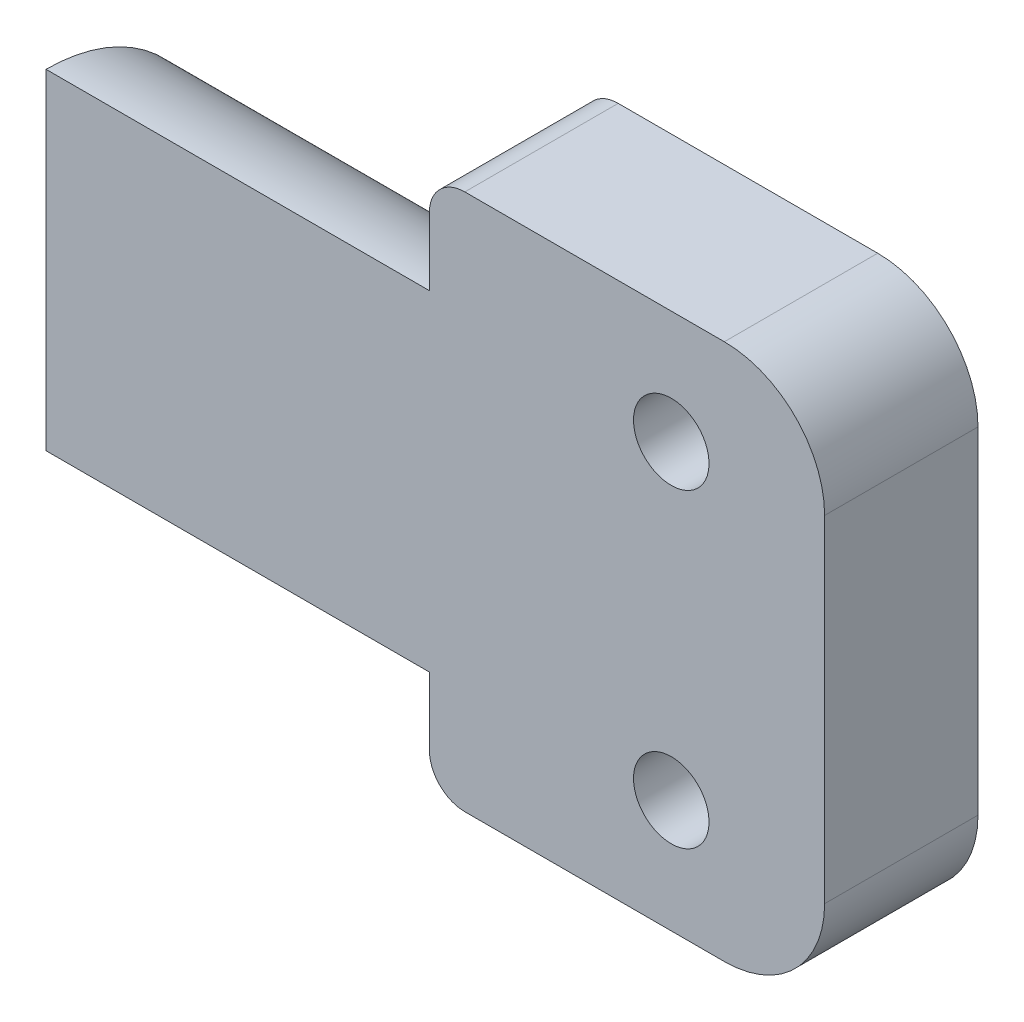
ISO-10303-21;
HEADER;
FILE_DESCRIPTION(('STEP AP214'),'2;1');
FILE_NAME('part.step','',(''),(''),'','','');
FILE_SCHEMA(('AUTOMOTIVE_DESIGN { 1 0 10303 214 1 1 1 1 }'));
ENDSEC;
DATA;
#1=APPLICATION_CONTEXT('core data for automotive mechanical design processes');
#2=APPLICATION_PROTOCOL_DEFINITION('international standard','automotive_design',2000,#1);
#3=PRODUCT_CONTEXT('',#1,'mechanical');
#4=PRODUCT('Part','Part','',(#3));
#5=PRODUCT_RELATED_PRODUCT_CATEGORY('part','',(#4));
#6=PRODUCT_DEFINITION_FORMATION('','',#4);
#7=PRODUCT_DEFINITION_CONTEXT('part definition',#1,'design');
#8=PRODUCT_DEFINITION('design','',#6,#7);
#9=PRODUCT_DEFINITION_SHAPE('','',#8);
#10=(LENGTH_UNIT() NAMED_UNIT(*) SI_UNIT(.MILLI.,.METRE.));
#11=(NAMED_UNIT(*) PLANE_ANGLE_UNIT() SI_UNIT($,.RADIAN.));
#12=(NAMED_UNIT(*) SI_UNIT($,.STERADIAN.) SOLID_ANGLE_UNIT());
#13=UNCERTAINTY_MEASURE_WITH_UNIT(LENGTH_MEASURE(1.E-05),#10,'distance_accuracy_value','');
#14=(GEOMETRIC_REPRESENTATION_CONTEXT(3) GLOBAL_UNCERTAINTY_ASSIGNED_CONTEXT((#13)) GLOBAL_UNIT_ASSIGNED_CONTEXT((#10,
#11,#12)) REPRESENTATION_CONTEXT('',''));
#15=CARTESIAN_POINT('',(0.,0.,0.));
#16=DIRECTION('',(0.,0.,1.));
#17=DIRECTION('',(1.,0.,0.));
#18=AXIS2_PLACEMENT_3D('',#15,#16,#17);
#19=CARTESIAN_POINT('',(165.5,94.25,93.6));
#20=DIRECTION('',(0.,0.,-1.));
#21=DIRECTION('',(-1.,0.,0.));
#22=AXIS2_PLACEMENT_3D('',#19,#20,#21);
#23=PLANE('',#22);
#24=CARTESIAN_POINT('',(165.5,94.25,93.6));
#25=DIRECTION('',(0.,0.,1.));
#26=DIRECTION('',(1.,0.,0.));
#27=AXIS2_PLACEMENT_3D('',#24,#25,#26);
#28=CIRCLE('',#27,3.09999999999999);
#29=CARTESIAN_POINT('',(168.6,94.25,93.6));
#30=VERTEX_POINT('',#29);
#31=EDGE_CURVE('E19',#30,#30,#28,.F.);
#32=ORIENTED_EDGE('',*,*,#31,.T.);
#33=EDGE_LOOP('',(#32));
#34=FACE_BOUND('',#33,.T.);
#35=ADVANCED_FACE('F16',(#34),#23,.T.);
#36=CARTESIAN_POINT('',(165.5,123.75,93.6));
#37=DIRECTION('',(0.,0.,-1.));
#38=DIRECTION('',(-1.,0.,0.));
#39=AXIS2_PLACEMENT_3D('',#36,#37,#38);
#40=PLANE('',#39);
#41=CARTESIAN_POINT('',(165.5,123.75,93.6));
#42=DIRECTION('',(0.,0.,1.));
#43=DIRECTION('',(1.,0.,0.));
#44=AXIS2_PLACEMENT_3D('',#41,#42,#43);
#45=CIRCLE('',#44,3.09999999999999);
#46=CARTESIAN_POINT('',(168.6,123.75,93.6));
#47=VERTEX_POINT('',#46);
#48=EDGE_CURVE('E239',#47,#47,#45,.F.);
#49=ORIENTED_EDGE('',*,*,#48,.T.);
#50=EDGE_LOOP('',(#49));
#51=FACE_BOUND('',#50,.T.);
#52=ADVANCED_FACE('F254',(#51),#40,.T.);
#53=CARTESIAN_POINT('',(165.5,94.25,84.1));
#54=DIRECTION('',(0.,0.,1.));
#55=DIRECTION('',(1.,0.,0.));
#56=AXIS2_PLACEMENT_3D('',#53,#54,#55);
#57=CYLINDRICAL_SURFACE('',#56,3.09999999999999);
#58=ORIENTED_EDGE('',*,*,#31,.F.);
#59=EDGE_LOOP('',(#58));
#60=FACE_BOUND('',#59,.T.);
#61=CARTESIAN_POINT('',(165.5,94.25,84.1));
#62=DIRECTION('',(0.,0.,1.));
#63=DIRECTION('',(1.,0.,0.));
#64=AXIS2_PLACEMENT_3D('',#61,#62,#63);
#65=CIRCLE('',#64,3.09999999999999);
#66=CARTESIAN_POINT('',(168.6,94.25,84.1));
#67=VERTEX_POINT('',#66);
#68=EDGE_CURVE('E236',#67,#67,#65,.T.);
#69=ORIENTED_EDGE('',*,*,#68,.F.);
#70=EDGE_LOOP('',(#69));
#71=FACE_BOUND('',#70,.T.);
#72=ADVANCED_FACE('F250',(#60,#71),#57,.F.);
#73=CARTESIAN_POINT('',(165.5,123.75,84.1));
#74=DIRECTION('',(0.,0.,1.));
#75=DIRECTION('',(1.,0.,0.));
#76=AXIS2_PLACEMENT_3D('',#73,#74,#75);
#77=CYLINDRICAL_SURFACE('',#76,3.09999999999999);
#78=ORIENTED_EDGE('',*,*,#48,.F.);
#79=EDGE_LOOP('',(#78));
#80=FACE_BOUND('',#79,.T.);
#81=CARTESIAN_POINT('',(165.5,123.75,84.1));
#82=DIRECTION('',(0.,0.,1.));
#83=DIRECTION('',(1.,0.,0.));
#84=AXIS2_PLACEMENT_3D('',#81,#82,#83);
#85=CIRCLE('',#84,3.09999999999999);
#86=CARTESIAN_POINT('',(168.6,123.75,84.1));
#87=VERTEX_POINT('',#86);
#88=EDGE_CURVE('E229',#87,#87,#85,.T.);
#89=ORIENTED_EDGE('',*,*,#88,.F.);
#90=EDGE_LOOP('',(#89));
#91=FACE_BOUND('',#90,.T.);
#92=ADVANCED_FACE('F253',(#80,#91),#77,.F.);
#93=CARTESIAN_POINT('',(180.,118.405,84.1));
#94=DIRECTION('',(0.,0.,1.));
#95=DIRECTION('',(1.,0.,0.));
#96=AXIS2_PLACEMENT_3D('',#93,#94,#95);
#97=CYLINDRICAL_SURFACE('',#96,2.);
#98=DIRECTION('',(0.,0.,-1.));
#99=VECTOR('',#98,1.);
#100=CARTESIAN_POINT('',(182.,118.405,84.1));
#101=LINE('',#100,#99);
#102=CARTESIAN_POINT('',(182.,118.405,91.1));
#103=VERTEX_POINT('',#102);
#104=CARTESIAN_POINT('',(182.,118.405,84.1));
#105=VERTEX_POINT('',#104);
#106=EDGE_CURVE('E372',#103,#105,#101,.T.);
#107=ORIENTED_EDGE('',*,*,#106,.T.);
#108=CARTESIAN_POINT('',(180.,118.405,84.1));
#109=DIRECTION('',(0.,0.,1.));
#110=DIRECTION('',(1.,0.,0.));
#111=AXIS2_PLACEMENT_3D('',#108,#109,#110);
#112=CIRCLE('',#111,2.);
#113=CARTESIAN_POINT('',(180.,116.405,84.1));
#114=VERTEX_POINT('',#113);
#115=EDGE_CURVE('E336',#114,#105,#112,.T.);
#116=ORIENTED_EDGE('',*,*,#115,.F.);
#117=DIRECTION('',(0.,0.,-1.));
#118=VECTOR('',#117,1.);
#119=CARTESIAN_POINT('',(180.,116.405,84.1));
#120=LINE('',#119,#118);
#121=CARTESIAN_POINT('',(180.,116.405,91.1));
#122=VERTEX_POINT('',#121);
#123=EDGE_CURVE('E241',#114,#122,#120,.F.);
#124=ORIENTED_EDGE('',*,*,#123,.T.);
#125=CARTESIAN_POINT('',(180.,118.405,91.1));
#126=DIRECTION('',(0.,0.,1.));
#127=DIRECTION('',(1.,0.,0.));
#128=AXIS2_PLACEMENT_3D('',#125,#126,#127);
#129=CIRCLE('',#128,2.);
#130=EDGE_CURVE('E323',#103,#122,#129,.F.);
#131=ORIENTED_EDGE('',*,*,#130,.F.);
#132=EDGE_LOOP('',(#107,#116,#124,#131));
#133=FACE_BOUND('',#132,.T.);
#134=ADVANCED_FACE('F558',(#133),#97,.F.);
#135=CARTESIAN_POINT('',(172.,116.405,84.1));
#136=DIRECTION('',(0.,-1.,0.));
#137=DIRECTION('',(0.,0.,-1.));
#138=AXIS2_PLACEMENT_3D('',#135,#136,#137);
#139=PLANE('',#138);
#140=DIRECTION('',(-1.,0.,0.));
#141=VECTOR('',#140,1.);
#142=CARTESIAN_POINT('',(157.,116.405,84.1));
#143=LINE('',#142,#141);
#144=CARTESIAN_POINT('',(174.,116.405,84.1));
#145=VERTEX_POINT('',#144);
#146=EDGE_CURVE('E337',#145,#114,#143,.F.);
#147=ORIENTED_EDGE('',*,*,#146,.F.);
#148=DIRECTION('',(0.,0.,1.));
#149=VECTOR('',#148,1.);
#150=CARTESIAN_POINT('',(174.,116.405,84.1));
#151=LINE('',#150,#149);
#152=CARTESIAN_POINT('',(174.,116.405,91.1));
#153=VERTEX_POINT('',#152);
#154=EDGE_CURVE('E244',#145,#153,#151,.T.);
#155=ORIENTED_EDGE('',*,*,#154,.T.);
#156=DIRECTION('',(-1.,0.,0.));
#157=VECTOR('',#156,1.);
#158=CARTESIAN_POINT('',(177.,116.405,91.1));
#159=LINE('',#158,#157);
#160=EDGE_CURVE('E320',#122,#153,#159,.T.);
#161=ORIENTED_EDGE('',*,*,#160,.F.);
#162=ORIENTED_EDGE('',*,*,#123,.F.);
#163=EDGE_LOOP('',(#147,#155,#161,#162));
#164=FACE_BOUND('',#163,.T.);
#165=ADVANCED_FACE('F562',(#164),#139,.F.);
#166=CARTESIAN_POINT('',(174.,118.405,84.1));
#167=DIRECTION('',(0.,0.,1.));
#168=DIRECTION('',(1.,0.,0.));
#169=AXIS2_PLACEMENT_3D('',#166,#167,#168);
#170=CYLINDRICAL_SURFACE('',#169,2.);
#171=ORIENTED_EDGE('',*,*,#154,.F.);
#172=CARTESIAN_POINT('',(174.,118.405,84.1));
#173=DIRECTION('',(0.,0.,1.));
#174=DIRECTION('',(1.,0.,0.));
#175=AXIS2_PLACEMENT_3D('',#172,#173,#174);
#176=CIRCLE('',#175,2.);
#177=CARTESIAN_POINT('',(172.,118.405,84.1));
#178=VERTEX_POINT('',#177);
#179=EDGE_CURVE('E327',#178,#145,#176,.T.);
#180=ORIENTED_EDGE('',*,*,#179,.F.);
#181=DIRECTION('',(0.,0.,1.));
#182=VECTOR('',#181,1.);
#183=CARTESIAN_POINT('',(172.,118.405,84.1));
#184=LINE('',#183,#182);
#185=CARTESIAN_POINT('',(172.,118.405,91.1));
#186=VERTEX_POINT('',#185);
#187=EDGE_CURVE('E382',#178,#186,#184,.T.);
#188=ORIENTED_EDGE('',*,*,#187,.T.);
#189=CARTESIAN_POINT('',(174.,118.405,91.1));
#190=DIRECTION('',(0.,0.,1.));
#191=DIRECTION('',(1.,0.,0.));
#192=AXIS2_PLACEMENT_3D('',#189,#190,#191);
#193=CIRCLE('',#192,2.);
#194=EDGE_CURVE('E319',#153,#186,#193,.F.);
#195=ORIENTED_EDGE('',*,*,#194,.F.);
#196=EDGE_LOOP('',(#171,#180,#188,#195));
#197=FACE_BOUND('',#196,.T.);
#198=ADVANCED_FACE('F566',(#197),#170,.F.);
#199=CARTESIAN_POINT('',(172.,127.905,84.1));
#200=DIRECTION('',(-1.,0.,0.));
#201=DIRECTION('',(0.,0.,1.));
#202=AXIS2_PLACEMENT_3D('',#199,#200,#201);
#203=PLANE('',#202);
#204=DIRECTION('',(0.,1.,0.));
#205=VECTOR('',#204,1.);
#206=CARTESIAN_POINT('',(172.,109.,84.1));
#207=LINE('',#206,#205);
#208=CARTESIAN_POINT('',(172.,125.905,84.1));
#209=VERTEX_POINT('',#208);
#210=EDGE_CURVE('E324',#209,#178,#207,.F.);
#211=ORIENTED_EDGE('',*,*,#210,.F.);
#212=DIRECTION('',(0.,0.,1.));
#213=VECTOR('',#212,1.);
#214=CARTESIAN_POINT('',(172.,125.905,84.1));
#215=LINE('',#214,#213);
#216=CARTESIAN_POINT('',(172.,125.905,91.1));
#217=VERTEX_POINT('',#216);
#218=EDGE_CURVE('E380',#209,#217,#215,.T.);
#219=ORIENTED_EDGE('',*,*,#218,.T.);
#220=DIRECTION('',(0.,1.,0.));
#221=VECTOR('',#220,1.);
#222=CARTESIAN_POINT('',(172.,122.155,91.1));
#223=LINE('',#222,#221);
#224=EDGE_CURVE('E316',#186,#217,#223,.T.);
#225=ORIENTED_EDGE('',*,*,#224,.F.);
#226=ORIENTED_EDGE('',*,*,#187,.F.);
#227=EDGE_LOOP('',(#211,#219,#225,#226));
#228=FACE_BOUND('',#227,.T.);
#229=ADVANCED_FACE('F570',(#228),#203,.F.);
#230=CARTESIAN_POINT('',(174.,125.905,84.1));
#231=DIRECTION('',(0.,0.,1.));
#232=DIRECTION('',(1.,0.,0.));
#233=AXIS2_PLACEMENT_3D('',#230,#231,#232);
#234=CYLINDRICAL_SURFACE('',#233,2.);
#235=ORIENTED_EDGE('',*,*,#218,.F.);
#236=CARTESIAN_POINT('',(174.,125.905,84.1));
#237=DIRECTION('',(0.,0.,1.));
#238=DIRECTION('',(1.,0.,0.));
#239=AXIS2_PLACEMENT_3D('',#236,#237,#238);
#240=CIRCLE('',#239,2.);
#241=CARTESIAN_POINT('',(174.,127.905,84.1));
#242=VERTEX_POINT('',#241);
#243=EDGE_CURVE('E328',#242,#209,#240,.T.);
#244=ORIENTED_EDGE('',*,*,#243,.F.);
#245=DIRECTION('',(0.,0.,1.));
#246=VECTOR('',#245,1.);
#247=CARTESIAN_POINT('',(174.,127.905,84.1));
#248=LINE('',#247,#246);
#249=CARTESIAN_POINT('',(174.,127.905,91.1));
#250=VERTEX_POINT('',#249);
#251=EDGE_CURVE('E378',#242,#250,#248,.T.);
#252=ORIENTED_EDGE('',*,*,#251,.T.);
#253=CARTESIAN_POINT('',(174.,125.905,91.1));
#254=DIRECTION('',(0.,0.,1.));
#255=DIRECTION('',(1.,0.,0.));
#256=AXIS2_PLACEMENT_3D('',#253,#254,#255);
#257=CIRCLE('',#256,2.);
#258=EDGE_CURVE('E315',#217,#250,#257,.F.);
#259=ORIENTED_EDGE('',*,*,#258,.F.);
#260=EDGE_LOOP('',(#235,#244,#252,#259));
#261=FACE_BOUND('',#260,.T.);
#262=ADVANCED_FACE('F573',(#261),#234,.F.);
#263=CARTESIAN_POINT('',(182.,127.905,84.1));
#264=DIRECTION('',(0.,1.,0.));
#265=DIRECTION('',(0.,0.,1.));
#266=AXIS2_PLACEMENT_3D('',#263,#264,#265);
#267=PLANE('',#266);
#268=DIRECTION('',(-1.,0.,0.));
#269=VECTOR('',#268,1.);
#270=CARTESIAN_POINT('',(177.,127.905,91.1));
#271=LINE('',#270,#269);
#272=CARTESIAN_POINT('',(180.,127.905,91.1));
#273=VERTEX_POINT('',#272);
#274=EDGE_CURVE('E312',#250,#273,#271,.F.);
#275=ORIENTED_EDGE('',*,*,#274,.F.);
#276=ORIENTED_EDGE('',*,*,#251,.F.);
#277=DIRECTION('',(-1.,0.,0.));
#278=VECTOR('',#277,1.);
#279=CARTESIAN_POINT('',(157.,127.905,84.1));
#280=LINE('',#279,#278);
#281=CARTESIAN_POINT('',(180.,127.905,84.1));
#282=VERTEX_POINT('',#281);
#283=EDGE_CURVE('E329',#282,#242,#280,.T.);
#284=ORIENTED_EDGE('',*,*,#283,.F.);
#285=DIRECTION('',(0.,0.,1.));
#286=VECTOR('',#285,1.);
#287=CARTESIAN_POINT('',(180.,127.905,84.1));
#288=LINE('',#287,#286);
#289=EDGE_CURVE('E375',#282,#273,#288,.T.);
#290=ORIENTED_EDGE('',*,*,#289,.T.);
#291=EDGE_LOOP('',(#275,#276,#284,#290));
#292=FACE_BOUND('',#291,.T.);
#293=ADVANCED_FACE('F576',(#292),#267,.F.);
#294=CARTESIAN_POINT('',(180.,125.905,84.1));
#295=DIRECTION('',(0.,0.,1.));
#296=DIRECTION('',(1.,0.,0.));
#297=AXIS2_PLACEMENT_3D('',#294,#295,#296);
#298=CYLINDRICAL_SURFACE('',#297,2.);
#299=ORIENTED_EDGE('',*,*,#289,.F.);
#300=CARTESIAN_POINT('',(180.,125.905,84.1));
#301=DIRECTION('',(0.,0.,1.));
#302=DIRECTION('',(1.,0.,0.));
#303=AXIS2_PLACEMENT_3D('',#300,#301,#302);
#304=CIRCLE('',#303,2.);
#305=CARTESIAN_POINT('',(182.,125.905,84.1));
#306=VERTEX_POINT('',#305);
#307=EDGE_CURVE('E332',#306,#282,#304,.T.);
#308=ORIENTED_EDGE('',*,*,#307,.F.);
#309=DIRECTION('',(0.,0.,-1.));
#310=VECTOR('',#309,1.);
#311=CARTESIAN_POINT('',(182.,125.905,84.1));
#312=LINE('',#311,#310);
#313=CARTESIAN_POINT('',(182.,125.905,91.1));
#314=VERTEX_POINT('',#313);
#315=EDGE_CURVE('E373',#306,#314,#312,.F.);
#316=ORIENTED_EDGE('',*,*,#315,.T.);
#317=CARTESIAN_POINT('',(180.,125.905,91.1));
#318=DIRECTION('',(0.,0.,1.));
#319=DIRECTION('',(1.,0.,0.));
#320=AXIS2_PLACEMENT_3D('',#317,#318,#319);
#321=CIRCLE('',#320,2.);
#322=EDGE_CURVE('E311',#273,#314,#321,.F.);
#323=ORIENTED_EDGE('',*,*,#322,.F.);
#324=EDGE_LOOP('',(#299,#308,#316,#323));
#325=FACE_BOUND('',#324,.T.);
#326=ADVANCED_FACE('F549',(#325),#298,.F.);
#327=CARTESIAN_POINT('',(182.,116.405,84.1));
#328=DIRECTION('',(1.,0.,0.));
#329=DIRECTION('',(0.,0.,-1.));
#330=AXIS2_PLACEMENT_3D('',#327,#328,#329);
#331=PLANE('',#330);
#332=DIRECTION('',(0.,1.,0.));
#333=VECTOR('',#332,1.);
#334=CARTESIAN_POINT('',(182.,122.155,91.1));
#335=LINE('',#334,#333);
#336=EDGE_CURVE('E308',#314,#103,#335,.F.);
#337=ORIENTED_EDGE('',*,*,#336,.F.);
#338=ORIENTED_EDGE('',*,*,#315,.F.);
#339=DIRECTION('',(0.,1.,0.));
#340=VECTOR('',#339,1.);
#341=CARTESIAN_POINT('',(182.,109.,84.1));
#342=LINE('',#341,#340);
#343=EDGE_CURVE('E333',#105,#306,#342,.T.);
#344=ORIENTED_EDGE('',*,*,#343,.F.);
#345=ORIENTED_EDGE('',*,*,#106,.F.);
#346=EDGE_LOOP('',(#337,#338,#344,#345));
#347=FACE_BOUND('',#346,.T.);
#348=ADVANCED_FACE('F555',(#347),#331,.F.);
#349=CARTESIAN_POINT('',(180.,99.595,84.1));
#350=DIRECTION('',(0.,0.,1.));
#351=DIRECTION('',(1.,0.,0.));
#352=AXIS2_PLACEMENT_3D('',#349,#350,#351);
#353=CYLINDRICAL_SURFACE('',#352,2.);
#354=DIRECTION('',(0.,0.,1.));
#355=VECTOR('',#354,1.);
#356=CARTESIAN_POINT('',(180.,101.595,84.1));
#357=LINE('',#356,#355);
#358=CARTESIAN_POINT('',(180.,101.595,91.1));
#359=VERTEX_POINT('',#358);
#360=CARTESIAN_POINT('',(180.,101.595,84.1));
#361=VERTEX_POINT('',#360);
#362=EDGE_CURVE('E238',#359,#361,#357,.F.);
#363=ORIENTED_EDGE('',*,*,#362,.T.);
#364=CARTESIAN_POINT('',(180.,99.595,84.1));
#365=DIRECTION('',(0.,0.,1.));
#366=DIRECTION('',(1.,0.,0.));
#367=AXIS2_PLACEMENT_3D('',#364,#365,#366);
#368=CIRCLE('',#367,2.);
#369=CARTESIAN_POINT('',(182.,99.595,84.1));
#370=VERTEX_POINT('',#369);
#371=EDGE_CURVE('E221',#370,#361,#368,.T.);
#372=ORIENTED_EDGE('',*,*,#371,.F.);
#373=DIRECTION('',(0.,0.,-1.));
#374=VECTOR('',#373,1.);
#375=CARTESIAN_POINT('',(182.,99.595,84.1));
#376=LINE('',#375,#374);
#377=CARTESIAN_POINT('',(182.,99.595,91.1));
#378=VERTEX_POINT('',#377);
#379=EDGE_CURVE('E213',#370,#378,#376,.F.);
#380=ORIENTED_EDGE('',*,*,#379,.T.);
#381=CARTESIAN_POINT('',(180.,99.595,91.1));
#382=DIRECTION('',(0.,0.,1.));
#383=DIRECTION('',(1.,0.,0.));
#384=AXIS2_PLACEMENT_3D('',#381,#382,#383);
#385=CIRCLE('',#384,2.);
#386=EDGE_CURVE('E307',#359,#378,#385,.F.);
#387=ORIENTED_EDGE('',*,*,#386,.F.);
#388=EDGE_LOOP('',(#363,#372,#380,#387));
#389=FACE_BOUND('',#388,.T.);
#390=ADVANCED_FACE('F468',(#389),#353,.F.);
#391=CARTESIAN_POINT('',(182.,90.095,84.1));
#392=DIRECTION('',(1.,0.,0.));
#393=DIRECTION('',(0.,0.,-1.));
#394=AXIS2_PLACEMENT_3D('',#391,#392,#393);
#395=PLANE('',#394);
#396=DIRECTION('',(0.,1.,0.));
#397=VECTOR('',#396,1.);
#398=CARTESIAN_POINT('',(182.,109.,84.1));
#399=LINE('',#398,#397);
#400=CARTESIAN_POINT('',(182.,92.095,84.1));
#401=VERTEX_POINT('',#400);
#402=EDGE_CURVE('E216',#401,#370,#399,.T.);
#403=ORIENTED_EDGE('',*,*,#402,.F.);
#404=DIRECTION('',(0.,0.,1.));
#405=VECTOR('',#404,1.);
#406=CARTESIAN_POINT('',(182.,92.095,84.1));
#407=LINE('',#406,#405);
#408=CARTESIAN_POINT('',(182.,92.095,91.1));
#409=VERTEX_POINT('',#408);
#410=EDGE_CURVE('E202',#401,#409,#407,.T.);
#411=ORIENTED_EDGE('',*,*,#410,.T.);
#412=DIRECTION('',(0.,1.,0.));
#413=VECTOR('',#412,1.);
#414=CARTESIAN_POINT('',(182.,95.845,91.1));
#415=LINE('',#414,#413);
#416=EDGE_CURVE('E305',#378,#409,#415,.F.);
#417=ORIENTED_EDGE('',*,*,#416,.F.);
#418=ORIENTED_EDGE('',*,*,#379,.F.);
#419=EDGE_LOOP('',(#403,#411,#417,#418));
#420=FACE_BOUND('',#419,.T.);
#421=ADVANCED_FACE('F217',(#420),#395,.F.);
#422=CARTESIAN_POINT('',(180.,92.095,84.1));
#423=DIRECTION('',(0.,0.,1.));
#424=DIRECTION('',(1.,0.,0.));
#425=AXIS2_PLACEMENT_3D('',#422,#423,#424);
#426=CYLINDRICAL_SURFACE('',#425,2.);
#427=ORIENTED_EDGE('',*,*,#410,.F.);
#428=CARTESIAN_POINT('',(180.,92.095,84.1));
#429=DIRECTION('',(0.,0.,1.));
#430=DIRECTION('',(1.,0.,0.));
#431=AXIS2_PLACEMENT_3D('',#428,#429,#430);
#432=CIRCLE('',#431,2.);
#433=CARTESIAN_POINT('',(180.,90.095,84.1));
#434=VERTEX_POINT('',#433);
#435=EDGE_CURVE('E206',#434,#401,#432,.T.);
#436=ORIENTED_EDGE('',*,*,#435,.F.);
#437=DIRECTION('',(0.,0.,-1.));
#438=VECTOR('',#437,1.);
#439=CARTESIAN_POINT('',(180.,90.095,84.1));
#440=LINE('',#439,#438);
#441=CARTESIAN_POINT('',(180.,90.095,91.1));
#442=VERTEX_POINT('',#441);
#443=EDGE_CURVE('E197',#434,#442,#440,.F.);
#444=ORIENTED_EDGE('',*,*,#443,.T.);
#445=CARTESIAN_POINT('',(180.,92.095,91.1));
#446=DIRECTION('',(0.,0.,1.));
#447=DIRECTION('',(1.,0.,0.));
#448=AXIS2_PLACEMENT_3D('',#445,#446,#447);
#449=CIRCLE('',#448,2.);
#450=EDGE_CURVE('E209',#409,#442,#449,.F.);
#451=ORIENTED_EDGE('',*,*,#450,.F.);
#452=EDGE_LOOP('',(#427,#436,#444,#451));
#453=FACE_BOUND('',#452,.T.);
#454=ADVANCED_FACE('F204',(#453),#426,.F.);
#455=CARTESIAN_POINT('',(172.,90.095,84.1));
#456=DIRECTION('',(0.,-1.,0.));
#457=DIRECTION('',(0.,0.,-1.));
#458=AXIS2_PLACEMENT_3D('',#455,#456,#457);
#459=PLANE('',#458);
#460=DIRECTION('',(-1.,0.,0.));
#461=VECTOR('',#460,1.);
#462=CARTESIAN_POINT('',(177.,90.095,91.1));
#463=LINE('',#462,#461);
#464=CARTESIAN_POINT('',(174.,90.095,91.1));
#465=VERTEX_POINT('',#464);
#466=EDGE_CURVE('E302',#442,#465,#463,.T.);
#467=ORIENTED_EDGE('',*,*,#466,.F.);
#468=ORIENTED_EDGE('',*,*,#443,.F.);
#469=DIRECTION('',(-1.,0.,0.));
#470=VECTOR('',#469,1.);
#471=CARTESIAN_POINT('',(157.,90.095,84.1));
#472=LINE('',#471,#470);
#473=CARTESIAN_POINT('',(174.,90.095,84.1));
#474=VERTEX_POINT('',#473);
#475=EDGE_CURVE('E227',#474,#434,#472,.F.);
#476=ORIENTED_EDGE('',*,*,#475,.F.);
#477=DIRECTION('',(0.,0.,1.));
#478=VECTOR('',#477,1.);
#479=CARTESIAN_POINT('',(174.,90.0949999999999,84.1));
#480=LINE('',#479,#478);
#481=EDGE_CURVE('E368',#474,#465,#480,.T.);
#482=ORIENTED_EDGE('',*,*,#481,.T.);
#483=EDGE_LOOP('',(#467,#468,#476,#482));
#484=FACE_BOUND('',#483,.T.);
#485=ADVANCED_FACE('F463',(#484),#459,.F.);
#486=CARTESIAN_POINT('',(174.,92.0949999999999,84.1));
#487=DIRECTION('',(0.,0.,1.));
#488=DIRECTION('',(1.,0.,0.));
#489=AXIS2_PLACEMENT_3D('',#486,#487,#488);
#490=CYLINDRICAL_SURFACE('',#489,2.);
#491=ORIENTED_EDGE('',*,*,#481,.F.);
#492=CARTESIAN_POINT('',(174.,92.0949999999999,84.1));
#493=DIRECTION('',(0.,0.,1.));
#494=DIRECTION('',(1.,0.,0.));
#495=AXIS2_PLACEMENT_3D('',#492,#493,#494);
#496=CIRCLE('',#495,2.);
#497=CARTESIAN_POINT('',(172.,92.0949999999999,84.1));
#498=VERTEX_POINT('',#497);
#499=EDGE_CURVE('E340',#498,#474,#496,.T.);
#500=ORIENTED_EDGE('',*,*,#499,.F.);
#501=DIRECTION('',(0.,0.,1.));
#502=VECTOR('',#501,1.);
#503=CARTESIAN_POINT('',(172.,92.0949999999999,84.1));
#504=LINE('',#503,#502);
#505=CARTESIAN_POINT('',(172.,92.0949999999999,91.1));
#506=VERTEX_POINT('',#505);
#507=EDGE_CURVE('E366',#498,#506,#504,.T.);
#508=ORIENTED_EDGE('',*,*,#507,.T.);
#509=CARTESIAN_POINT('',(174.,92.0949999999999,91.1));
#510=DIRECTION('',(0.,0.,1.));
#511=DIRECTION('',(1.,0.,0.));
#512=AXIS2_PLACEMENT_3D('',#509,#510,#511);
#513=CIRCLE('',#512,2.);
#514=EDGE_CURVE('E301',#465,#506,#513,.F.);
#515=ORIENTED_EDGE('',*,*,#514,.F.);
#516=EDGE_LOOP('',(#491,#500,#508,#515));
#517=FACE_BOUND('',#516,.T.);
#518=ADVANCED_FACE('F462',(#517),#490,.F.);
#519=CARTESIAN_POINT('',(172.,101.595,84.1));
#520=DIRECTION('',(-1.,0.,0.));
#521=DIRECTION('',(0.,0.,1.));
#522=AXIS2_PLACEMENT_3D('',#519,#520,#521);
#523=PLANE('',#522);
#524=DIRECTION('',(0.,1.,0.));
#525=VECTOR('',#524,1.);
#526=CARTESIAN_POINT('',(172.,95.845,91.1));
#527=LINE('',#526,#525);
#528=CARTESIAN_POINT('',(172.,99.595,91.1));
#529=VERTEX_POINT('',#528);
#530=EDGE_CURVE('E298',#506,#529,#527,.T.);
#531=ORIENTED_EDGE('',*,*,#530,.F.);
#532=ORIENTED_EDGE('',*,*,#507,.F.);
#533=DIRECTION('',(0.,1.,0.));
#534=VECTOR('',#533,1.);
#535=CARTESIAN_POINT('',(172.,109.,84.1));
#536=LINE('',#535,#534);
#537=CARTESIAN_POINT('',(172.,99.595,84.1));
#538=VERTEX_POINT('',#537);
#539=EDGE_CURVE('E341',#538,#498,#536,.F.);
#540=ORIENTED_EDGE('',*,*,#539,.F.);
#541=DIRECTION('',(0.,0.,1.));
#542=VECTOR('',#541,1.);
#543=CARTESIAN_POINT('',(172.,99.595,84.1));
#544=LINE('',#543,#542);
#545=EDGE_CURVE('E363',#538,#529,#544,.T.);
#546=ORIENTED_EDGE('',*,*,#545,.T.);
#547=EDGE_LOOP('',(#531,#532,#540,#546));
#548=FACE_BOUND('',#547,.T.);
#549=ADVANCED_FACE('F457',(#548),#523,.F.);
#550=CARTESIAN_POINT('',(174.,99.595,84.1));
#551=DIRECTION('',(0.,0.,1.));
#552=DIRECTION('',(1.,0.,0.));
#553=AXIS2_PLACEMENT_3D('',#550,#551,#552);
#554=CYLINDRICAL_SURFACE('',#553,2.);
#555=ORIENTED_EDGE('',*,*,#545,.F.);
#556=CARTESIAN_POINT('',(174.,99.595,84.1));
#557=DIRECTION('',(0.,0.,1.));
#558=DIRECTION('',(1.,0.,0.));
#559=AXIS2_PLACEMENT_3D('',#556,#557,#558);
#560=CIRCLE('',#559,2.);
#561=CARTESIAN_POINT('',(174.,101.595,84.1));
#562=VERTEX_POINT('',#561);
#563=EDGE_CURVE('E343',#562,#538,#560,.T.);
#564=ORIENTED_EDGE('',*,*,#563,.F.);
#565=DIRECTION('',(0.,0.,1.));
#566=VECTOR('',#565,1.);
#567=CARTESIAN_POINT('',(174.,101.595,84.1));
#568=LINE('',#567,#566);
#569=CARTESIAN_POINT('',(174.,101.595,91.1));
#570=VERTEX_POINT('',#569);
#571=EDGE_CURVE('E361',#562,#570,#568,.T.);
#572=ORIENTED_EDGE('',*,*,#571,.T.);
#573=CARTESIAN_POINT('',(174.,99.595,91.1));
#574=DIRECTION('',(0.,0.,1.));
#575=DIRECTION('',(1.,0.,0.));
#576=AXIS2_PLACEMENT_3D('',#573,#574,#575);
#577=CIRCLE('',#576,2.);
#578=EDGE_CURVE('E297',#529,#570,#577,.F.);
#579=ORIENTED_EDGE('',*,*,#578,.F.);
#580=EDGE_LOOP('',(#555,#564,#572,#579));
#581=FACE_BOUND('',#580,.T.);
#582=ADVANCED_FACE('F452',(#581),#554,.F.);
#583=CARTESIAN_POINT('',(182.,101.595,84.1));
#584=DIRECTION('',(0.,1.,0.));
#585=DIRECTION('',(0.,0.,1.));
#586=AXIS2_PLACEMENT_3D('',#583,#584,#585);
#587=PLANE('',#586);
#588=DIRECTION('',(-1.,0.,0.));
#589=VECTOR('',#588,1.);
#590=CARTESIAN_POINT('',(177.,101.595,91.1));
#591=LINE('',#590,#589);
#592=EDGE_CURVE('E294',#570,#359,#591,.F.);
#593=ORIENTED_EDGE('',*,*,#592,.F.);
#594=ORIENTED_EDGE('',*,*,#571,.F.);
#595=DIRECTION('',(-1.,0.,0.));
#596=VECTOR('',#595,1.);
#597=CARTESIAN_POINT('',(157.,101.595,84.1));
#598=LINE('',#597,#596);
#599=EDGE_CURVE('E344',#361,#562,#598,.T.);
#600=ORIENTED_EDGE('',*,*,#599,.F.);
#601=ORIENTED_EDGE('',*,*,#362,.F.);
#602=EDGE_LOOP('',(#593,#594,#600,#601));
#603=FACE_BOUND('',#602,.T.);
#604=ADVANCED_FACE('F261',(#603),#587,.F.);
#605=CARTESIAN_POINT('',(157.,109.,84.1));
#606=DIRECTION('',(0.,0.,-1.));
#607=DIRECTION('',(-1.,0.,0.));
#608=AXIS2_PLACEMENT_3D('',#605,#606,#607);
#609=PLANE('',#608);
#610=ORIENTED_EDGE('',*,*,#210,.T.);
#611=ORIENTED_EDGE('',*,*,#179,.T.);
#612=ORIENTED_EDGE('',*,*,#146,.T.);
#613=ORIENTED_EDGE('',*,*,#115,.T.);
#614=ORIENTED_EDGE('',*,*,#343,.T.);
#615=ORIENTED_EDGE('',*,*,#307,.T.);
#616=ORIENTED_EDGE('',*,*,#283,.T.);
#617=ORIENTED_EDGE('',*,*,#243,.T.);
#618=EDGE_LOOP('',(#610,#611,#612,#613,#614,#615,#616,#617));
#619=FACE_BOUND('',#618,.T.);
#620=ORIENTED_EDGE('',*,*,#539,.T.);
#621=ORIENTED_EDGE('',*,*,#499,.T.);
#622=ORIENTED_EDGE('',*,*,#475,.T.);
#623=ORIENTED_EDGE('',*,*,#435,.T.);
#624=ORIENTED_EDGE('',*,*,#402,.T.);
#625=ORIENTED_EDGE('',*,*,#371,.T.);
#626=ORIENTED_EDGE('',*,*,#599,.T.);
#627=ORIENTED_EDGE('',*,*,#563,.T.);
#628=EDGE_LOOP('',(#620,#621,#622,#623,#624,#625,#626,#627));
#629=FACE_BOUND('',#628,.T.);
#630=ORIENTED_EDGE('',*,*,#88,.T.);
#631=EDGE_LOOP('',(#630));
#632=FACE_BOUND('',#631,.T.);
#633=ORIENTED_EDGE('',*,*,#68,.T.);
#634=EDGE_LOOP('',(#633));
#635=FACE_BOUND('',#634,.T.);
#636=CARTESIAN_POINT('',(181.5,123.25,84.1));
#637=DIRECTION('',(0.,0.,-1.));
#638=DIRECTION('',(-1.,0.,0.));
#639=AXIS2_PLACEMENT_3D('',#636,#637,#638);
#640=CIRCLE('',#639,8.5);
#641=CARTESIAN_POINT('',(190.,123.25,84.1));
#642=VERTEX_POINT('',#641);
#643=CARTESIAN_POINT('',(181.5,131.75,84.1));
#644=VERTEX_POINT('',#643);
#645=EDGE_CURVE('E266',#642,#644,#640,.F.);
#646=ORIENTED_EDGE('',*,*,#645,.F.);
#647=DIRECTION('',(0.,1.,0.));
#648=VECTOR('',#647,1.);
#649=CARTESIAN_POINT('',(190.,131.75,84.1));
#650=LINE('',#649,#648);
#651=CARTESIAN_POINT('',(190.,94.75,84.1));
#652=VERTEX_POINT('',#651);
#653=EDGE_CURVE('E268',#652,#642,#650,.T.);
#654=ORIENTED_EDGE('',*,*,#653,.F.);
#655=CARTESIAN_POINT('',(181.5,94.75,84.1));
#656=DIRECTION('',(0.,0.,-1.));
#657=DIRECTION('',(-1.,0.,0.));
#658=AXIS2_PLACEMENT_3D('',#655,#656,#657);
#659=CIRCLE('',#658,8.5);
#660=CARTESIAN_POINT('',(181.5,86.25,84.1));
#661=VERTEX_POINT('',#660);
#662=EDGE_CURVE('E293',#661,#652,#659,.F.);
#663=ORIENTED_EDGE('',*,*,#662,.F.);
#664=DIRECTION('',(1.,0.,0.));
#665=VECTOR('',#664,1.);
#666=CARTESIAN_POINT('',(190.,86.25,84.1));
#667=LINE('',#666,#665);
#668=CARTESIAN_POINT('',(159.5,86.25,84.1));
#669=VERTEX_POINT('',#668);
#670=EDGE_CURVE('E347',#669,#661,#667,.T.);
#671=ORIENTED_EDGE('',*,*,#670,.F.);
#672=CARTESIAN_POINT('',(159.5,89.25,84.1));
#673=DIRECTION('',(0.,0.,-1.));
#674=DIRECTION('',(-1.,0.,0.));
#675=AXIS2_PLACEMENT_3D('',#672,#673,#674);
#676=CIRCLE('',#675,3.);
#677=CARTESIAN_POINT('',(156.5,89.25,84.1));
#678=VERTEX_POINT('',#677);
#679=EDGE_CURVE('E407',#678,#669,#676,.F.);
#680=ORIENTED_EDGE('',*,*,#679,.F.);
#681=DIRECTION('',(0.,1.,0.));
#682=VECTOR('',#681,1.);
#683=CARTESIAN_POINT('',(156.5,86.25,84.1));
#684=LINE('',#683,#682);
#685=CARTESIAN_POINT('',(156.5,103.803847577293,84.1000000000001));
#686=VERTEX_POINT('',#685);
#687=EDGE_CURVE('E410',#686,#678,#684,.F.);
#688=ORIENTED_EDGE('',*,*,#687,.F.);
#689=DIRECTION('',(1.,0.,0.));
#690=VECTOR('',#689,1.);
#691=CARTESIAN_POINT('',(124.,103.803847577293,84.1000000000001));
#692=LINE('',#691,#690);
#693=CARTESIAN_POINT('',(124.,103.803847577293,84.1000000000001));
#694=VERTEX_POINT('',#693);
#695=EDGE_CURVE('E351',#694,#686,#692,.T.);
#696=ORIENTED_EDGE('',*,*,#695,.F.);
#697=DIRECTION('',(0.,1.,0.));
#698=VECTOR('',#697,1.);
#699=CARTESIAN_POINT('',(124.,95.,84.1));
#700=LINE('',#699,#698);
#701=CARTESIAN_POINT('',(124.,114.196152422707,84.1000000000001));
#702=VERTEX_POINT('',#701);
#703=EDGE_CURVE('E415',#702,#694,#700,.F.);
#704=ORIENTED_EDGE('',*,*,#703,.F.);
#705=DIRECTION('',(1.,0.,0.));
#706=VECTOR('',#705,1.);
#707=CARTESIAN_POINT('',(124.,114.196152422707,84.1000000000001));
#708=LINE('',#707,#706);
#709=CARTESIAN_POINT('',(156.5,114.196152422707,84.1000000000001));
#710=VERTEX_POINT('',#709);
#711=EDGE_CURVE('E355',#710,#702,#708,.F.);
#712=ORIENTED_EDGE('',*,*,#711,.F.);
#713=DIRECTION('',(0.,-1.,0.));
#714=VECTOR('',#713,1.);
#715=CARTESIAN_POINT('',(156.5,123.,84.1));
#716=LINE('',#715,#714);
#717=CARTESIAN_POINT('',(156.5,128.75,84.1));
#718=VERTEX_POINT('',#717);
#719=EDGE_CURVE('E420',#718,#710,#716,.T.);
#720=ORIENTED_EDGE('',*,*,#719,.F.);
#721=CARTESIAN_POINT('',(159.5,128.75,84.1));
#722=DIRECTION('',(0.,0.,-1.));
#723=DIRECTION('',(-1.,0.,0.));
#724=AXIS2_PLACEMENT_3D('',#721,#722,#723);
#725=CIRCLE('',#724,3.);
#726=CARTESIAN_POINT('',(159.5,131.75,84.1));
#727=VERTEX_POINT('',#726);
#728=EDGE_CURVE('E359',#727,#718,#725,.F.);
#729=ORIENTED_EDGE('',*,*,#728,.F.);
#730=DIRECTION('',(-1.,0.,0.));
#731=VECTOR('',#730,1.);
#732=CARTESIAN_POINT('',(156.5,131.75,84.1));
#733=LINE('',#732,#731);
#734=EDGE_CURVE('E271',#644,#727,#733,.T.);
#735=ORIENTED_EDGE('',*,*,#734,.F.);
#736=EDGE_LOOP('',(#646,#654,#663,#671,#680,#688,#696,#704,#712,#720,#729,#735));
#737=FACE_BOUND('',#736,.T.);
#738=ADVANCED_FACE('F224',(#619,#629,#632,#635,#737),#609,.T.);
#739=CARTESIAN_POINT('',(177.,122.155,91.1));
#740=DIRECTION('',(0.,0.,-1.));
#741=DIRECTION('',(-1.,0.,0.));
#742=AXIS2_PLACEMENT_3D('',#739,#740,#741);
#743=PLANE('',#742);
#744=CARTESIAN_POINT('',(177.,122.155,91.1));
#745=DIRECTION('',(0.,0.,-1.));
#746=DIRECTION('',(-1.,0.,0.));
#747=AXIS2_PLACEMENT_3D('',#744,#745,#746);
#748=CIRCLE('',#747,3.2);
#749=CARTESIAN_POINT('',(173.8,122.155,91.1));
#750=VERTEX_POINT('',#749);
#751=EDGE_CURVE('E350',#750,#750,#748,.F.);
#752=ORIENTED_EDGE('',*,*,#751,.T.);
#753=EDGE_LOOP('',(#752));
#754=FACE_BOUND('',#753,.T.);
#755=ORIENTED_EDGE('',*,*,#322,.T.);
#756=ORIENTED_EDGE('',*,*,#336,.T.);
#757=ORIENTED_EDGE('',*,*,#130,.T.);
#758=ORIENTED_EDGE('',*,*,#160,.T.);
#759=ORIENTED_EDGE('',*,*,#194,.T.);
#760=ORIENTED_EDGE('',*,*,#224,.T.);
#761=ORIENTED_EDGE('',*,*,#258,.T.);
#762=ORIENTED_EDGE('',*,*,#274,.T.);
#763=EDGE_LOOP('',(#755,#756,#757,#758,#759,#760,#761,#762));
#764=FACE_BOUND('',#763,.T.);
#765=ADVANCED_FACE('F260',(#754,#764),#743,.T.);
#766=CARTESIAN_POINT('',(177.,95.845,91.1));
#767=DIRECTION('',(0.,0.,-1.));
#768=DIRECTION('',(-1.,0.,0.));
#769=AXIS2_PLACEMENT_3D('',#766,#767,#768);
#770=PLANE('',#769);
#771=CARTESIAN_POINT('',(177.,95.845,91.1));
#772=DIRECTION('',(0.,0.,-1.));
#773=DIRECTION('',(-1.,0.,0.));
#774=AXIS2_PLACEMENT_3D('',#771,#772,#773);
#775=CIRCLE('',#774,3.2);
#776=CARTESIAN_POINT('',(173.8,95.845,91.1));
#777=VERTEX_POINT('',#776);
#778=EDGE_CURVE('E402',#777,#777,#775,.F.);
#779=ORIENTED_EDGE('',*,*,#778,.T.);
#780=EDGE_LOOP('',(#779));
#781=FACE_BOUND('',#780,.T.);
#782=ORIENTED_EDGE('',*,*,#578,.T.);
#783=ORIENTED_EDGE('',*,*,#592,.T.);
#784=ORIENTED_EDGE('',*,*,#386,.T.);
#785=ORIENTED_EDGE('',*,*,#416,.T.);
#786=ORIENTED_EDGE('',*,*,#450,.T.);
#787=ORIENTED_EDGE('',*,*,#466,.T.);
#788=ORIENTED_EDGE('',*,*,#514,.T.);
#789=ORIENTED_EDGE('',*,*,#530,.T.);
#790=EDGE_LOOP('',(#782,#783,#784,#785,#786,#787,#788,#789));
#791=FACE_BOUND('',#790,.T.);
#792=ADVANCED_FACE('F465',(#781,#791),#770,.T.);
#793=CARTESIAN_POINT('',(181.5,94.75,97.1));
#794=DIRECTION('',(0.,0.,-1.));
#795=DIRECTION('',(-1.,0.,0.));
#796=AXIS2_PLACEMENT_3D('',#793,#794,#795);
#797=CYLINDRICAL_SURFACE('',#796,8.5);
#798=CARTESIAN_POINT('',(181.5,94.75,97.1));
#799=DIRECTION('',(0.,0.,-1.));
#800=DIRECTION('',(-1.,0.,0.));
#801=AXIS2_PLACEMENT_3D('',#798,#799,#800);
#802=CIRCLE('',#801,8.5);
#803=CARTESIAN_POINT('',(181.5,86.25,97.1));
#804=VERTEX_POINT('',#803);
#805=CARTESIAN_POINT('',(190.,94.75,97.1));
#806=VERTEX_POINT('',#805);
#807=EDGE_CURVE('E399',#804,#806,#802,.F.);
#808=ORIENTED_EDGE('',*,*,#807,.F.);
#809=DIRECTION('',(0.,0.,1.));
#810=VECTOR('',#809,1.);
#811=CARTESIAN_POINT('',(181.5,86.25,97.1));
#812=LINE('',#811,#810);
#813=EDGE_CURVE('E851',#661,#804,#812,.T.);
#814=ORIENTED_EDGE('',*,*,#813,.F.);
#815=ORIENTED_EDGE('',*,*,#662,.T.);
#816=DIRECTION('',(0.,0.,1.));
#817=VECTOR('',#816,1.);
#818=CARTESIAN_POINT('',(190.,94.75,97.1));
#819=LINE('',#818,#817);
#820=EDGE_CURVE('E281',#806,#652,#819,.F.);
#821=ORIENTED_EDGE('',*,*,#820,.F.);
#822=EDGE_LOOP('',(#808,#814,#815,#821));
#823=FACE_BOUND('',#822,.T.);
#824=ADVANCED_FACE('F532',(#823),#797,.T.);
#825=CARTESIAN_POINT('',(190.,131.75,97.1));
#826=DIRECTION('',(1.,0.,0.));
#827=DIRECTION('',(0.,1.,0.));
#828=AXIS2_PLACEMENT_3D('',#825,#826,#827);
#829=PLANE('',#828);
#830=DIRECTION('',(0.,0.,-1.));
#831=VECTOR('',#830,1.);
#832=CARTESIAN_POINT('',(190.,123.25,97.1));
#833=LINE('',#832,#831);
#834=CARTESIAN_POINT('',(190.,123.25,97.1));
#835=VERTEX_POINT('',#834);
#836=EDGE_CURVE('E275',#835,#642,#833,.T.);
#837=ORIENTED_EDGE('',*,*,#836,.F.);
#838=DIRECTION('',(0.,1.,0.));
#839=VECTOR('',#838,1.);
#840=CARTESIAN_POINT('',(190.,109.,97.1));
#841=LINE('',#840,#839);
#842=EDGE_CURVE('E398',#806,#835,#841,.T.);
#843=ORIENTED_EDGE('',*,*,#842,.F.);
#844=ORIENTED_EDGE('',*,*,#820,.T.);
#845=ORIENTED_EDGE('',*,*,#653,.T.);
#846=EDGE_LOOP('',(#837,#843,#844,#845));
#847=FACE_BOUND('',#846,.T.);
#848=ADVANCED_FACE('F278',(#847),#829,.T.);
#849=CARTESIAN_POINT('',(181.5,123.25,97.1));
#850=DIRECTION('',(0.,0.,-1.));
#851=DIRECTION('',(-1.,0.,0.));
#852=AXIS2_PLACEMENT_3D('',#849,#850,#851);
#853=CYLINDRICAL_SURFACE('',#852,8.5);
#854=CARTESIAN_POINT('',(181.5,123.25,97.1));
#855=DIRECTION('',(0.,0.,-1.));
#856=DIRECTION('',(-1.,0.,0.));
#857=AXIS2_PLACEMENT_3D('',#854,#855,#856);
#858=CIRCLE('',#857,8.5);
#859=CARTESIAN_POINT('',(181.5,131.75,97.1));
#860=VERTEX_POINT('',#859);
#861=EDGE_CURVE('E285',#835,#860,#858,.F.);
#862=ORIENTED_EDGE('',*,*,#861,.F.);
#863=ORIENTED_EDGE('',*,*,#836,.T.);
#864=ORIENTED_EDGE('',*,*,#645,.T.);
#865=DIRECTION('',(0.,0.,1.));
#866=VECTOR('',#865,1.);
#867=CARTESIAN_POINT('',(181.5,131.75,97.1));
#868=LINE('',#867,#866);
#869=EDGE_CURVE('E287',#860,#644,#868,.F.);
#870=ORIENTED_EDGE('',*,*,#869,.F.);
#871=EDGE_LOOP('',(#862,#863,#864,#870));
#872=FACE_BOUND('',#871,.T.);
#873=ADVANCED_FACE('F283',(#872),#853,.T.);
#874=CARTESIAN_POINT('',(156.5,131.75,97.1));
#875=DIRECTION('',(0.,1.,0.));
#876=DIRECTION('',(-1.,0.,0.));
#877=AXIS2_PLACEMENT_3D('',#874,#875,#876);
#878=PLANE('',#877);
#879=DIRECTION('',(0.,0.,-1.));
#880=VECTOR('',#879,1.);
#881=CARTESIAN_POINT('',(159.5,131.75,97.1));
#882=LINE('',#881,#880);
#883=CARTESIAN_POINT('',(159.5,131.75,97.1));
#884=VERTEX_POINT('',#883);
#885=EDGE_CURVE('E421',#884,#727,#882,.T.);
#886=ORIENTED_EDGE('',*,*,#885,.F.);
#887=DIRECTION('',(1.,0.,0.));
#888=VECTOR('',#887,1.);
#889=CARTESIAN_POINT('',(157.,131.75,97.1));
#890=LINE('',#889,#888);
#891=EDGE_CURVE('E396',#860,#884,#890,.F.);
#892=ORIENTED_EDGE('',*,*,#891,.F.);
#893=ORIENTED_EDGE('',*,*,#869,.T.);
#894=ORIENTED_EDGE('',*,*,#734,.T.);
#895=EDGE_LOOP('',(#886,#892,#893,#894));
#896=FACE_BOUND('',#895,.T.);
#897=ADVANCED_FACE('F523',(#896),#878,.T.);
#898=CARTESIAN_POINT('',(159.5,128.75,97.1));
#899=DIRECTION('',(0.,0.,-1.));
#900=DIRECTION('',(-1.,0.,0.));
#901=AXIS2_PLACEMENT_3D('',#898,#899,#900);
#902=CYLINDRICAL_SURFACE('',#901,3.);
#903=CARTESIAN_POINT('',(159.5,128.75,97.1));
#904=DIRECTION('',(0.,0.,-1.));
#905=DIRECTION('',(-1.,0.,0.));
#906=AXIS2_PLACEMENT_3D('',#903,#904,#905);
#907=CIRCLE('',#906,3.);
#908=CARTESIAN_POINT('',(156.5,128.75,97.1));
#909=VERTEX_POINT('',#908);
#910=EDGE_CURVE('E392',#884,#909,#907,.F.);
#911=ORIENTED_EDGE('',*,*,#910,.F.);
#912=ORIENTED_EDGE('',*,*,#885,.T.);
#913=ORIENTED_EDGE('',*,*,#728,.T.);
#914=DIRECTION('',(0.,0.,1.));
#915=VECTOR('',#914,1.);
#916=CARTESIAN_POINT('',(156.5,128.75,97.1));
#917=LINE('',#916,#915);
#918=EDGE_CURVE('E868',#909,#718,#917,.F.);
#919=ORIENTED_EDGE('',*,*,#918,.F.);
#920=EDGE_LOOP('',(#911,#912,#913,#919));
#921=FACE_BOUND('',#920,.T.);
#922=ADVANCED_FACE('F519',(#921),#902,.T.);
#923=CARTESIAN_POINT('',(156.5,123.,97.1));
#924=DIRECTION('',(-1.,0.,0.));
#925=DIRECTION('',(0.,-1.,0.));
#926=AXIS2_PLACEMENT_3D('',#923,#924,#925);
#927=PLANE('',#926);
#928=CARTESIAN_POINT('',(156.5,109.,97.1));
#929=DIRECTION('',(1.,0.,0.));
#930=DIRECTION('',(0.,0.,-1.));
#931=AXIS2_PLACEMENT_3D('',#928,#929,#930);
#932=CIRCLE('',#931,14.);
#933=CARTESIAN_POINT('',(156.5,123.,97.1));
#934=VERTEX_POINT('',#933);
#935=EDGE_CURVE('E358',#934,#710,#932,.F.);
#936=ORIENTED_EDGE('',*,*,#935,.F.);
#937=DIRECTION('',(0.,1.,0.));
#938=VECTOR('',#937,1.);
#939=CARTESIAN_POINT('',(156.5,109.,97.1));
#940=LINE('',#939,#938);
#941=EDGE_CURVE('E395',#909,#934,#940,.F.);
#942=ORIENTED_EDGE('',*,*,#941,.F.);
#943=ORIENTED_EDGE('',*,*,#918,.T.);
#944=ORIENTED_EDGE('',*,*,#719,.T.);
#945=EDGE_LOOP('',(#936,#942,#943,#944));
#946=FACE_BOUND('',#945,.T.);
#947=ADVANCED_FACE('F515',(#946),#927,.T.);
#948=CARTESIAN_POINT('',(124.,109.,97.1));
#949=DIRECTION('',(1.,0.,0.));
#950=DIRECTION('',(0.,0.,-1.));
#951=AXIS2_PLACEMENT_3D('',#948,#949,#950);
#952=CYLINDRICAL_SURFACE('',#951,14.);
#953=CARTESIAN_POINT('',(124.,109.,97.1));
#954=DIRECTION('',(1.,0.,0.));
#955=DIRECTION('',(0.,0.,-1.));
#956=AXIS2_PLACEMENT_3D('',#953,#954,#955);
#957=CIRCLE('',#956,14.);
#958=CARTESIAN_POINT('',(124.,123.,97.1));
#959=VERTEX_POINT('',#958);
#960=EDGE_CURVE('E357',#959,#702,#957,.F.);
#961=ORIENTED_EDGE('',*,*,#960,.F.);
#962=DIRECTION('',(1.,0.,0.));
#963=VECTOR('',#962,1.);
#964=CARTESIAN_POINT('',(157.,123.,97.1));
#965=LINE('',#964,#963);
#966=EDGE_CURVE('E863',#934,#959,#965,.F.);
#967=ORIENTED_EDGE('',*,*,#966,.F.);
#968=ORIENTED_EDGE('',*,*,#935,.T.);
#969=ORIENTED_EDGE('',*,*,#711,.T.);
#970=EDGE_LOOP('',(#961,#967,#968,#969));
#971=FACE_BOUND('',#970,.T.);
#972=ADVANCED_FACE('F511',(#971),#952,.T.);
#973=CARTESIAN_POINT('',(124.,95.,97.1));
#974=DIRECTION('',(-1.,0.,0.));
#975=DIRECTION('',(0.,0.,1.));
#976=AXIS2_PLACEMENT_3D('',#973,#974,#975);
#977=PLANE('',#976);
#978=CARTESIAN_POINT('',(124.,109.,97.1));
#979=DIRECTION('',(1.,0.,0.));
#980=DIRECTION('',(0.,0.,-1.));
#981=AXIS2_PLACEMENT_3D('',#978,#979,#980);
#982=CIRCLE('',#981,14.);
#983=CARTESIAN_POINT('',(124.,95.,97.1));
#984=VERTEX_POINT('',#983);
#985=EDGE_CURVE('E354',#984,#694,#982,.T.);
#986=ORIENTED_EDGE('',*,*,#985,.F.);
#987=DIRECTION('',(0.,1.,0.));
#988=VECTOR('',#987,1.);
#989=CARTESIAN_POINT('',(124.,109.,97.1));
#990=LINE('',#989,#988);
#991=EDGE_CURVE('E860',#959,#984,#990,.F.);
#992=ORIENTED_EDGE('',*,*,#991,.F.);
#993=ORIENTED_EDGE('',*,*,#960,.T.);
#994=ORIENTED_EDGE('',*,*,#703,.T.);
#995=EDGE_LOOP('',(#986,#992,#993,#994));
#996=FACE_BOUND('',#995,.T.);
#997=ADVANCED_FACE('F507',(#996),#977,.T.);
#998=CARTESIAN_POINT('',(124.,109.,97.1));
#999=DIRECTION('',(1.,0.,0.));
#1000=DIRECTION('',(0.,0.,-1.));
#1001=AXIS2_PLACEMENT_3D('',#998,#999,#1000);
#1002=CYLINDRICAL_SURFACE('',#1001,14.);
#1003=ORIENTED_EDGE('',*,*,#985,.T.);
#1004=ORIENTED_EDGE('',*,*,#695,.T.);
#1005=CARTESIAN_POINT('',(156.5,109.,97.1));
#1006=DIRECTION('',(1.,0.,0.));
#1007=DIRECTION('',(0.,0.,-1.));
#1008=AXIS2_PLACEMENT_3D('',#1005,#1006,#1007);
#1009=CIRCLE('',#1008,14.);
#1010=CARTESIAN_POINT('',(156.5,95.,97.1));
#1011=VERTEX_POINT('',#1010);
#1012=EDGE_CURVE('E353',#1011,#686,#1009,.T.);
#1013=ORIENTED_EDGE('',*,*,#1012,.F.);
#1014=DIRECTION('',(1.,0.,0.));
#1015=VECTOR('',#1014,1.);
#1016=CARTESIAN_POINT('',(157.,95.,97.1));
#1017=LINE('',#1016,#1015);
#1018=EDGE_CURVE('E858',#984,#1011,#1017,.T.);
#1019=ORIENTED_EDGE('',*,*,#1018,.F.);
#1020=EDGE_LOOP('',(#1003,#1004,#1013,#1019));
#1021=FACE_BOUND('',#1020,.T.);
#1022=ADVANCED_FACE('F503',(#1021),#1002,.T.);
#1023=CARTESIAN_POINT('',(156.5,86.25,97.1));
#1024=DIRECTION('',(-1.,0.,0.));
#1025=DIRECTION('',(0.,0.,1.));
#1026=AXIS2_PLACEMENT_3D('',#1023,#1024,#1025);
#1027=PLANE('',#1026);
#1028=ORIENTED_EDGE('',*,*,#1012,.T.);
#1029=ORIENTED_EDGE('',*,*,#687,.T.);
#1030=DIRECTION('',(0.,0.,-1.));
#1031=VECTOR('',#1030,1.);
#1032=CARTESIAN_POINT('',(156.5,89.25,97.1));
#1033=LINE('',#1032,#1031);
#1034=CARTESIAN_POINT('',(156.5,89.25,97.1));
#1035=VERTEX_POINT('',#1034);
#1036=EDGE_CURVE('E409',#1035,#678,#1033,.T.);
#1037=ORIENTED_EDGE('',*,*,#1036,.F.);
#1038=DIRECTION('',(0.,1.,0.));
#1039=VECTOR('',#1038,1.);
#1040=CARTESIAN_POINT('',(156.5,109.,97.1));
#1041=LINE('',#1040,#1039);
#1042=EDGE_CURVE('E391',#1011,#1035,#1041,.F.);
#1043=ORIENTED_EDGE('',*,*,#1042,.F.);
#1044=EDGE_LOOP('',(#1028,#1029,#1037,#1043));
#1045=FACE_BOUND('',#1044,.T.);
#1046=ADVANCED_FACE('F500',(#1045),#1027,.T.);
#1047=CARTESIAN_POINT('',(159.5,89.25,97.1));
#1048=DIRECTION('',(0.,0.,-1.));
#1049=DIRECTION('',(-1.,0.,0.));
#1050=AXIS2_PLACEMENT_3D('',#1047,#1048,#1049);
#1051=CYLINDRICAL_SURFACE('',#1050,3.);
#1052=CARTESIAN_POINT('',(159.5,89.25,97.1));
#1053=DIRECTION('',(0.,0.,-1.));
#1054=DIRECTION('',(-1.,0.,0.));
#1055=AXIS2_PLACEMENT_3D('',#1052,#1053,#1054);
#1056=CIRCLE('',#1055,3.);
#1057=CARTESIAN_POINT('',(159.5,86.25,97.1));
#1058=VERTEX_POINT('',#1057);
#1059=EDGE_CURVE('E388',#1035,#1058,#1056,.F.);
#1060=ORIENTED_EDGE('',*,*,#1059,.F.);
#1061=ORIENTED_EDGE('',*,*,#1036,.T.);
#1062=ORIENTED_EDGE('',*,*,#679,.T.);
#1063=DIRECTION('',(0.,0.,1.));
#1064=VECTOR('',#1063,1.);
#1065=CARTESIAN_POINT('',(159.5,86.25,97.1));
#1066=LINE('',#1065,#1064);
#1067=EDGE_CURVE('E34',#1058,#669,#1066,.F.);
#1068=ORIENTED_EDGE('',*,*,#1067,.F.);
#1069=EDGE_LOOP('',(#1060,#1061,#1062,#1068));
#1070=FACE_BOUND('',#1069,.T.);
#1071=ADVANCED_FACE('F496',(#1070),#1051,.T.);
#1072=CARTESIAN_POINT('',(190.,86.25,97.1));
#1073=DIRECTION('',(0.,-1.,0.));
#1074=DIRECTION('',(1.,0.,0.));
#1075=AXIS2_PLACEMENT_3D('',#1072,#1073,#1074);
#1076=PLANE('',#1075);
#1077=ORIENTED_EDGE('',*,*,#1067,.T.);
#1078=ORIENTED_EDGE('',*,*,#670,.T.);
#1079=ORIENTED_EDGE('',*,*,#813,.T.);
#1080=DIRECTION('',(1.,0.,0.));
#1081=VECTOR('',#1080,1.);
#1082=CARTESIAN_POINT('',(157.,86.25,97.1));
#1083=LINE('',#1082,#1081);
#1084=EDGE_CURVE('E387',#1058,#804,#1083,.T.);
#1085=ORIENTED_EDGE('',*,*,#1084,.F.);
#1086=EDGE_LOOP('',(#1077,#1078,#1079,#1085));
#1087=FACE_BOUND('',#1086,.T.);
#1088=ADVANCED_FACE('F492',(#1087),#1076,.T.);
#1089=CARTESIAN_POINT('',(177.,122.155,95.8));
#1090=DIRECTION('',(0.,0.,-1.));
#1091=DIRECTION('',(-1.,0.,0.));
#1092=AXIS2_PLACEMENT_3D('',#1089,#1090,#1091);
#1093=CYLINDRICAL_SURFACE('',#1092,3.2);
#1094=ORIENTED_EDGE('',*,*,#751,.F.);
#1095=EDGE_LOOP('',(#1094));
#1096=FACE_BOUND('',#1095,.T.);
#1097=CARTESIAN_POINT('',(177.,122.155,97.1));
#1098=DIRECTION('',(0.,0.,-1.));
#1099=DIRECTION('',(-1.,0.,0.));
#1100=AXIS2_PLACEMENT_3D('',#1097,#1098,#1099);
#1101=CIRCLE('',#1100,3.2);
#1102=CARTESIAN_POINT('',(173.8,122.155,97.1));
#1103=VERTEX_POINT('',#1102);
#1104=EDGE_CURVE('E25',#1103,#1103,#1101,.T.);
#1105=ORIENTED_EDGE('',*,*,#1104,.F.);
#1106=EDGE_LOOP('',(#1105));
#1107=FACE_BOUND('',#1106,.T.);
#1108=ADVANCED_FACE('F485',(#1096,#1107),#1093,.F.);
#1109=CARTESIAN_POINT('',(177.,95.845,95.8));
#1110=DIRECTION('',(0.,0.,-1.));
#1111=DIRECTION('',(-1.,0.,0.));
#1112=AXIS2_PLACEMENT_3D('',#1109,#1110,#1111);
#1113=CYLINDRICAL_SURFACE('',#1112,3.2);
#1114=ORIENTED_EDGE('',*,*,#778,.F.);
#1115=EDGE_LOOP('',(#1114));
#1116=FACE_BOUND('',#1115,.T.);
#1117=CARTESIAN_POINT('',(177.,95.845,97.1));
#1118=DIRECTION('',(0.,0.,-1.));
#1119=DIRECTION('',(-1.,0.,0.));
#1120=AXIS2_PLACEMENT_3D('',#1117,#1118,#1119);
#1121=CIRCLE('',#1120,3.2);
#1122=CARTESIAN_POINT('',(173.8,95.845,97.1));
#1123=VERTEX_POINT('',#1122);
#1124=EDGE_CURVE('E11',#1123,#1123,#1121,.T.);
#1125=ORIENTED_EDGE('',*,*,#1124,.F.);
#1126=EDGE_LOOP('',(#1125));
#1127=FACE_BOUND('',#1126,.T.);
#1128=ADVANCED_FACE('F479',(#1116,#1127),#1113,.F.);
#1129=CARTESIAN_POINT('',(157.,109.,97.1));
#1130=DIRECTION('',(0.,0.,1.));
#1131=DIRECTION('',(1.,0.,0.));
#1132=AXIS2_PLACEMENT_3D('',#1129,#1130,#1131);
#1133=PLANE('',#1132);
#1134=ORIENTED_EDGE('',*,*,#1124,.T.);
#1135=EDGE_LOOP('',(#1134));
#1136=FACE_BOUND('',#1135,.T.);
#1137=ORIENTED_EDGE('',*,*,#1104,.T.);
#1138=EDGE_LOOP('',(#1137));
#1139=FACE_BOUND('',#1138,.T.);
#1140=ORIENTED_EDGE('',*,*,#1059,.T.);
#1141=ORIENTED_EDGE('',*,*,#1084,.T.);
#1142=ORIENTED_EDGE('',*,*,#807,.T.);
#1143=ORIENTED_EDGE('',*,*,#842,.T.);
#1144=ORIENTED_EDGE('',*,*,#861,.T.);
#1145=ORIENTED_EDGE('',*,*,#891,.T.);
#1146=ORIENTED_EDGE('',*,*,#910,.T.);
#1147=ORIENTED_EDGE('',*,*,#941,.T.);
#1148=ORIENTED_EDGE('',*,*,#966,.T.);
#1149=ORIENTED_EDGE('',*,*,#991,.T.);
#1150=ORIENTED_EDGE('',*,*,#1018,.T.);
#1151=ORIENTED_EDGE('',*,*,#1042,.T.);
#1152=EDGE_LOOP('',(#1140,#1141,#1142,#1143,#1144,#1145,#1146,#1147,#1148,#1149,#1150,#1151));
#1153=FACE_BOUND('',#1152,.T.);
#1154=ADVANCED_FACE('F477',(#1136,#1139,#1153),#1133,.T.);
#1155=CLOSED_SHELL('',(#35,#52,#72,#92,#134,#165,#198,#229,#262,#293,#326,#348,#390,#421,#454,
#485,#518,#549,#582,#604,#738,#765,#792,#824,#848,#873,#897,#922,#947,#972,#997,#1022,#1046,
#1071,#1088,#1108,#1128,#1154));
#1156=MANIFOLD_SOLID_BREP('B1',#1155);
#1157=ADVANCED_BREP_SHAPE_REPRESENTATION('',(#18,#1156),#14);
#1158=SHAPE_DEFINITION_REPRESENTATION(#9,#1157);
ENDSEC;
END-ISO-10303-21;
